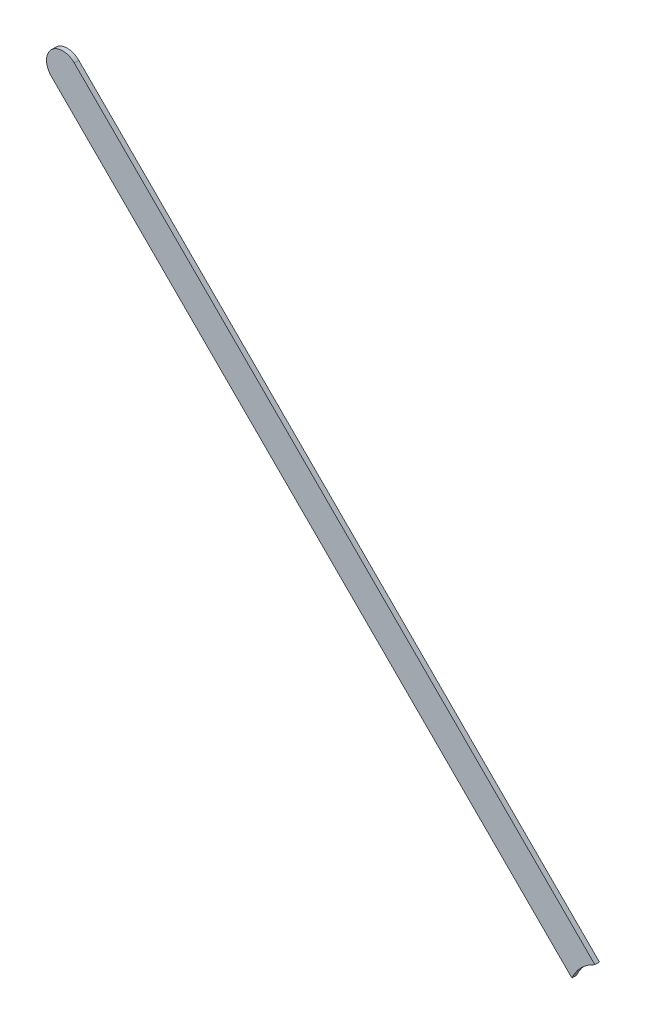
ISO-10303-21;
HEADER;
FILE_DESCRIPTION(('STEP AP214'),'2;1');
FILE_NAME('part.step','',(''),(''),'','','');
FILE_SCHEMA(('AUTOMOTIVE_DESIGN { 1 0 10303 214 1 1 1 1 }'));
ENDSEC;
DATA;
#1=APPLICATION_CONTEXT('core data for automotive mechanical design processes');
#2=APPLICATION_PROTOCOL_DEFINITION('international standard','automotive_design',2000,#1);
#3=PRODUCT_CONTEXT('',#1,'mechanical');
#4=PRODUCT('Part','Part','',(#3));
#5=PRODUCT_RELATED_PRODUCT_CATEGORY('part','',(#4));
#6=PRODUCT_DEFINITION_FORMATION('','',#4);
#7=PRODUCT_DEFINITION_CONTEXT('part definition',#1,'design');
#8=PRODUCT_DEFINITION('design','',#6,#7);
#9=PRODUCT_DEFINITION_SHAPE('','',#8);
#10=(LENGTH_UNIT() NAMED_UNIT(*) SI_UNIT(.MILLI.,.METRE.));
#11=(NAMED_UNIT(*) PLANE_ANGLE_UNIT() SI_UNIT($,.RADIAN.));
#12=(NAMED_UNIT(*) SI_UNIT($,.STERADIAN.) SOLID_ANGLE_UNIT());
#13=UNCERTAINTY_MEASURE_WITH_UNIT(LENGTH_MEASURE(1.E-05),#10,'distance_accuracy_value','');
#14=(GEOMETRIC_REPRESENTATION_CONTEXT(3) GLOBAL_UNCERTAINTY_ASSIGNED_CONTEXT((#13)) GLOBAL_UNIT_ASSIGNED_CONTEXT((#10,
#11,#12)) REPRESENTATION_CONTEXT('',''));
#15=CARTESIAN_POINT('',(0.,0.,0.));
#16=DIRECTION('',(0.,0.,1.));
#17=DIRECTION('',(1.,0.,0.));
#18=AXIS2_PLACEMENT_3D('',#15,#16,#17);
#19=CARTESIAN_POINT('',(90.12717052,59.39717356,0.));
#20=DIRECTION('',(0.707106781186546,0.707106781186549,0.));
#21=DIRECTION('',(0.707106781186549,-0.707106781186546,0.));
#22=AXIS2_PLACEMENT_3D('',#19,#20,#21);
#23=PLANE('',#22);
#24=DIRECTION('',(0.707106781186549,-0.707106781186546,0.));
#25=VECTOR('',#24,1.);
#26=CARTESIAN_POINT('',(90.12717052,59.39717356,0.03556));
#27=LINE('',#26,#25);
#28=CARTESIAN_POINT('',(90.12717052,59.39717356,0.03556));
#29=VERTEX_POINT('',#28);
#30=CARTESIAN_POINT('',(94.1923075771966,55.3320365028035,0.03556));
#31=VERTEX_POINT('',#30);
#32=EDGE_CURVE('E11',#29,#31,#27,.T.);
#33=ORIENTED_EDGE('',*,*,#32,.F.);
#34=DIRECTION('',(0.,0.,1.));
#35=VECTOR('',#34,1.);
#36=CARTESIAN_POINT('',(90.12717052,59.39717356,0.));
#37=LINE('',#36,#35);
#38=CARTESIAN_POINT('',(90.12717052,59.39717356,0.));
#39=VERTEX_POINT('',#38);
#40=EDGE_CURVE('E24',#39,#29,#37,.T.);
#41=ORIENTED_EDGE('',*,*,#40,.F.);
#42=DIRECTION('',(0.707106781186549,-0.707106781186546,0.));
#43=VECTOR('',#42,1.);
#44=CARTESIAN_POINT('',(90.12717052,59.39717356,0.));
#45=LINE('',#44,#43);
#46=CARTESIAN_POINT('',(94.1923075771966,55.3320365028035,0.));
#47=VERTEX_POINT('',#46);
#48=EDGE_CURVE('E75',#39,#47,#45,.T.);
#49=ORIENTED_EDGE('',*,*,#48,.T.);
#50=DIRECTION('',(0.,0.,1.));
#51=VECTOR('',#50,1.);
#52=CARTESIAN_POINT('',(94.1923075771966,55.3320365028035,0.));
#53=LINE('',#52,#51);
#54=EDGE_CURVE('E37',#47,#31,#53,.T.);
#55=ORIENTED_EDGE('',*,*,#54,.T.);
#56=EDGE_LOOP('',(#33,#41,#49,#55));
#57=FACE_BOUND('',#56,.T.);
#58=ADVANCED_FACE('F17',(#57),#23,.F.);
#59=CARTESIAN_POINT('',(94.51697378,55.1869737,0.));
#60=DIRECTION('',(0.,0.,-1.));
#61=DIRECTION('',(1.,0.,0.));
#62=AXIS2_PLACEMENT_3D('',#59,#60,#61);
#63=CYLINDRICAL_SURFACE('',#62,0.3556);
#64=DIRECTION('',(0.,0.,1.));
#65=VECTOR('',#64,1.);
#66=CARTESIAN_POINT('',(94.3719109771965,55.5116399028034,0.));
#67=LINE('',#66,#65);
#68=CARTESIAN_POINT('',(94.3719109771965,55.5116399028034,0.));
#69=VERTEX_POINT('',#68);
#70=CARTESIAN_POINT('',(94.3719109771965,55.5116399028034,0.03556));
#71=VERTEX_POINT('',#70);
#72=EDGE_CURVE('E67',#69,#71,#67,.T.);
#73=ORIENTED_EDGE('',*,*,#72,.T.);
#74=CARTESIAN_POINT('',(94.51697378,55.1869737,0.03556));
#75=DIRECTION('',(0.,0.,1.));
#76=DIRECTION('',(1.,0.,0.));
#77=AXIS2_PLACEMENT_3D('',#74,#75,#76);
#78=CIRCLE('',#77,0.3556);
#79=EDGE_CURVE('E82',#71,#31,#78,.T.);
#80=ORIENTED_EDGE('',*,*,#79,.T.);
#81=ORIENTED_EDGE('',*,*,#54,.F.);
#82=CARTESIAN_POINT('',(94.51697378,55.1869737,0.));
#83=DIRECTION('',(0.,0.,1.));
#84=DIRECTION('',(1.,0.,0.));
#85=AXIS2_PLACEMENT_3D('',#82,#83,#84);
#86=CIRCLE('',#85,0.3556);
#87=EDGE_CURVE('E80',#69,#47,#86,.T.);
#88=ORIENTED_EDGE('',*,*,#87,.F.);
#89=EDGE_LOOP('',(#73,#80,#81,#88));
#90=FACE_BOUND('',#89,.T.);
#91=ADVANCED_FACE('F88',(#90),#63,.F.);
#92=CARTESIAN_POINT('',(94.3719109771965,55.5116399028034,0.));
#93=DIRECTION('',(-0.707106781186548,-0.707106781186548,0.));
#94=DIRECTION('',(-0.707106781186548,0.707106781186548,0.));
#95=AXIS2_PLACEMENT_3D('',#92,#93,#94);
#96=PLANE('',#95);
#97=DIRECTION('',(-0.707106781186548,0.707106781186548,0.));
#98=VECTOR('',#97,1.);
#99=CARTESIAN_POINT('',(94.60677548,55.2767754,0.03556));
#100=LINE('',#99,#98);
#101=CARTESIAN_POINT('',(90.30677392,59.57677696,0.03556));
#102=VERTEX_POINT('',#101);
#103=EDGE_CURVE('E71',#71,#102,#100,.T.);
#104=ORIENTED_EDGE('',*,*,#103,.F.);
#105=ORIENTED_EDGE('',*,*,#72,.F.);
#106=DIRECTION('',(-0.707106781186548,0.707106781186548,0.));
#107=VECTOR('',#106,1.);
#108=CARTESIAN_POINT('',(94.60677548,55.2767754,0.));
#109=LINE('',#108,#107);
#110=CARTESIAN_POINT('',(90.30677392,59.57677696,0.));
#111=VERTEX_POINT('',#110);
#112=EDGE_CURVE('E63',#69,#111,#109,.T.);
#113=ORIENTED_EDGE('',*,*,#112,.T.);
#114=DIRECTION('',(0.,0.,1.));
#115=VECTOR('',#114,1.);
#116=CARTESIAN_POINT('',(90.30677392,59.57677696,0.));
#117=LINE('',#116,#115);
#118=EDGE_CURVE('E53',#111,#102,#117,.T.);
#119=ORIENTED_EDGE('',*,*,#118,.T.);
#120=EDGE_LOOP('',(#104,#105,#113,#119));
#121=FACE_BOUND('',#120,.T.);
#122=ADVANCED_FACE('F66',(#121),#96,.F.);
#123=CARTESIAN_POINT('',(90.21697222,59.48697526,0.));
#124=DIRECTION('',(0.,0.,-1.));
#125=DIRECTION('',(0.70710678118652,0.707106781186576,0.));
#126=AXIS2_PLACEMENT_3D('',#123,#124,#125);
#127=CYLINDRICAL_SURFACE('',#126,0.126998782064163);
#128=CARTESIAN_POINT('',(90.21697222,59.48697526,0.03556));
#129=DIRECTION('',(0.,0.,1.));
#130=DIRECTION('',(0.70710678118652,0.707106781186576,0.));
#131=AXIS2_PLACEMENT_3D('',#128,#129,#130);
#132=CIRCLE('',#131,0.126998782064163);
#133=EDGE_CURVE('E59',#102,#29,#132,.T.);
#134=ORIENTED_EDGE('',*,*,#133,.F.);
#135=ORIENTED_EDGE('',*,*,#118,.F.);
#136=CARTESIAN_POINT('',(90.21697222,59.48697526,0.));
#137=DIRECTION('',(0.,0.,1.));
#138=DIRECTION('',(0.70710678118652,0.707106781186576,0.));
#139=AXIS2_PLACEMENT_3D('',#136,#137,#138);
#140=CIRCLE('',#139,0.126998782064163);
#141=EDGE_CURVE('E57',#111,#39,#140,.T.);
#142=ORIENTED_EDGE('',*,*,#141,.T.);
#143=ORIENTED_EDGE('',*,*,#40,.T.);
#144=EDGE_LOOP('',(#134,#135,#142,#143));
#145=FACE_BOUND('',#144,.T.);
#146=ADVANCED_FACE('F55',(#145),#127,.T.);
#147=CARTESIAN_POINT('',(90.12717052,59.39717356,0.));
#148=DIRECTION('',(0.,0.,-1.));
#149=DIRECTION('',(-1.,0.,0.));
#150=AXIS2_PLACEMENT_3D('',#147,#148,#149);
#151=PLANE('',#150);
#152=ORIENTED_EDGE('',*,*,#48,.F.);
#153=ORIENTED_EDGE('',*,*,#141,.F.);
#154=ORIENTED_EDGE('',*,*,#112,.F.);
#155=ORIENTED_EDGE('',*,*,#87,.T.);
#156=EDGE_LOOP('',(#152,#153,#154,#155));
#157=FACE_BOUND('',#156,.T.);
#158=ADVANCED_FACE('F74',(#157),#151,.T.);
#159=CARTESIAN_POINT('',(90.12717052,59.39717356,0.03556));
#160=DIRECTION('',(0.,0.,-1.));
#161=DIRECTION('',(-1.,0.,0.));
#162=AXIS2_PLACEMENT_3D('',#159,#160,#161);
#163=PLANE('',#162);
#164=ORIENTED_EDGE('',*,*,#133,.T.);
#165=ORIENTED_EDGE('',*,*,#32,.T.);
#166=ORIENTED_EDGE('',*,*,#79,.F.);
#167=ORIENTED_EDGE('',*,*,#103,.T.);
#168=EDGE_LOOP('',(#164,#165,#166,#167));
#169=FACE_BOUND('',#168,.T.);
#170=ADVANCED_FACE('F91',(#169),#163,.F.);
#171=CLOSED_SHELL('',(#58,#91,#122,#146,#158,#170));
#172=MANIFOLD_SOLID_BREP('B1',#171);
#173=ADVANCED_BREP_SHAPE_REPRESENTATION('',(#18,#172),#14);
#174=SHAPE_DEFINITION_REPRESENTATION(#9,#173);
ENDSEC;
END-ISO-10303-21;
